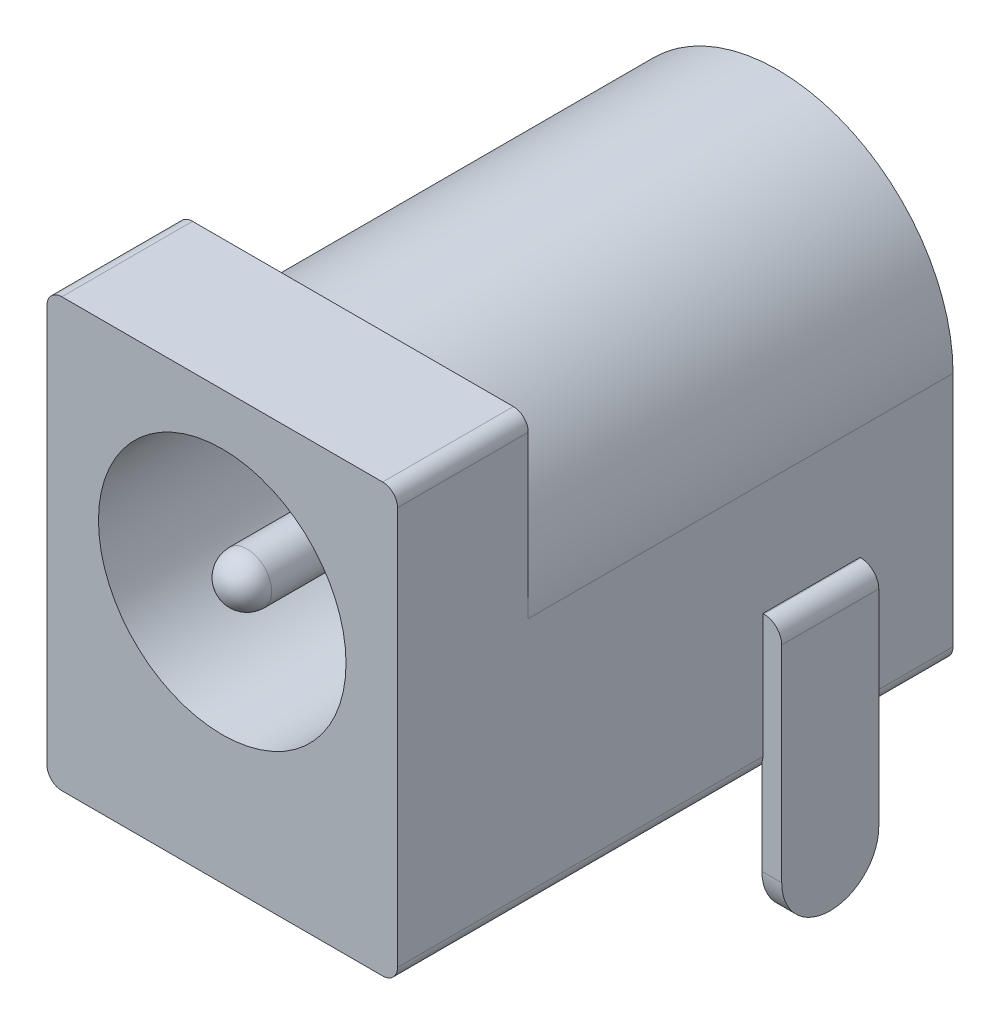
ISO-10303-21;
HEADER;
FILE_DESCRIPTION(('STEP AP214'),'2;1');
FILE_NAME('part.step','',(''),(''),'','','');
FILE_SCHEMA(('AUTOMOTIVE_DESIGN { 1 0 10303 214 1 1 1 1 }'));
ENDSEC;
DATA;
#1=APPLICATION_CONTEXT('core data for automotive mechanical design processes');
#2=APPLICATION_PROTOCOL_DEFINITION('international standard','automotive_design',2000,#1);
#3=PRODUCT_CONTEXT('',#1,'mechanical');
#4=PRODUCT('Part','Part','',(#3));
#5=PRODUCT_RELATED_PRODUCT_CATEGORY('part','',(#4));
#6=PRODUCT_DEFINITION_FORMATION('','',#4);
#7=PRODUCT_DEFINITION_CONTEXT('part definition',#1,'design');
#8=PRODUCT_DEFINITION('design','',#6,#7);
#9=PRODUCT_DEFINITION_SHAPE('','',#8);
#10=(LENGTH_UNIT() NAMED_UNIT(*) SI_UNIT(.MILLI.,.METRE.));
#11=(NAMED_UNIT(*) PLANE_ANGLE_UNIT() SI_UNIT($,.RADIAN.));
#12=(NAMED_UNIT(*) SI_UNIT($,.STERADIAN.) SOLID_ANGLE_UNIT());
#13=UNCERTAINTY_MEASURE_WITH_UNIT(LENGTH_MEASURE(1.E-05),#10,'distance_accuracy_value','');
#14=(GEOMETRIC_REPRESENTATION_CONTEXT(3) GLOBAL_UNCERTAINTY_ASSIGNED_CONTEXT((#13)) GLOBAL_UNIT_ASSIGNED_CONTEXT((#10,
#11,#12)) REPRESENTATION_CONTEXT('',''));
#15=CARTESIAN_POINT('',(0.,0.,0.));
#16=DIRECTION('',(0.,0.,1.));
#17=DIRECTION('',(1.,0.,0.));
#18=AXIS2_PLACEMENT_3D('',#15,#16,#17);
#19=CARTESIAN_POINT('',(8.9662,-3.683,2.3876));
#20=DIRECTION('',(-1.,0.,0.));
#21=DIRECTION('',(0.,0.,1.));
#22=AXIS2_PLACEMENT_3D('',#19,#20,#21);
#23=PLANE('',#22);
#24=DIRECTION('',(0.,1.,0.));
#25=VECTOR('',#24,1.);
#26=CARTESIAN_POINT('',(8.9662,-3.683,2.3876));
#27=LINE('',#26,#25);
#28=CARTESIAN_POINT('',(8.96619999999999,-2.1844,2.3876));
#29=VERTEX_POINT('',#28);
#30=CARTESIAN_POINT('',(8.9662,0.244216813898783,2.3876));
#31=VERTEX_POINT('',#30);
#32=EDGE_CURVE('E233',#29,#31,#27,.T.);
#33=ORIENTED_EDGE('',*,*,#32,.F.);
#34=CARTESIAN_POINT('',(8.96619999999999,-2.1844,3.6322));
#35=DIRECTION('',(1.,0.,0.));
#36=DIRECTION('',(0.,0.,-1.));
#37=AXIS2_PLACEMENT_3D('',#34,#35,#36);
#38=CIRCLE('',#37,1.2446);
#39=CARTESIAN_POINT('',(8.96619999999999,-2.1844,4.8768));
#40=VERTEX_POINT('',#39);
#41=EDGE_CURVE('E220',#40,#29,#38,.T.);
#42=ORIENTED_EDGE('',*,*,#41,.F.);
#43=DIRECTION('',(0.,1.,0.));
#44=VECTOR('',#43,1.);
#45=CARTESIAN_POINT('',(8.9662,-3.683,4.8768));
#46=LINE('',#45,#44);
#47=CARTESIAN_POINT('',(8.9662,0.244216813898783,4.8768));
#48=VERTEX_POINT('',#47);
#49=EDGE_CURVE('E253',#40,#48,#46,.T.);
#50=ORIENTED_EDGE('',*,*,#49,.T.);
#51=DIRECTION('',(0.,0.,-1.));
#52=VECTOR('',#51,1.);
#53=CARTESIAN_POINT('',(8.9662,0.244216813898783,14.2494));
#54=LINE('',#53,#52);
#55=EDGE_CURVE('E240',#31,#48,#54,.F.);
#56=ORIENTED_EDGE('',*,*,#55,.F.);
#57=EDGE_LOOP('',(#33,#42,#50,#56));
#58=FACE_BOUND('',#57,.T.);
#59=ADVANCED_FACE('F44',(#58),#23,.T.);
#60=CARTESIAN_POINT('',(8.9662,-3.683,2.3876));
#61=DIRECTION('',(0.,0.,1.));
#62=DIRECTION('',(1.,0.,0.));
#63=AXIS2_PLACEMENT_3D('',#60,#61,#62);
#64=PLANE('',#63);
#65=DIRECTION('',(1.,0.,0.));
#66=VECTOR('',#65,1.);
#67=CARTESIAN_POINT('',(8.96619999999999,-2.1844,2.3876));
#68=LINE('',#67,#66);
#69=CARTESIAN_POINT('',(9.47419999999999,-2.1844,2.3876));
#70=VERTEX_POINT('',#69);
#71=EDGE_CURVE('E59',#29,#70,#68,.T.);
#72=ORIENTED_EDGE('',*,*,#71,.F.);
#73=ORIENTED_EDGE('',*,*,#32,.T.);
#74=CARTESIAN_POINT('',(8.6106,0.380999999999999,2.3876));
#75=DIRECTION('',(0.,0.,1.));
#76=DIRECTION('',(1.,0.,0.));
#77=AXIS2_PLACEMENT_3D('',#74,#75,#76);
#78=CIRCLE('',#77,0.380999999999999);
#79=CARTESIAN_POINT('',(8.99159999999999,0.380999999999999,2.3876));
#80=VERTEX_POINT('',#79);
#81=EDGE_CURVE('E244',#31,#80,#78,.T.);
#82=ORIENTED_EDGE('',*,*,#81,.T.);
#83=DIRECTION('',(0.,-1.,0.));
#84=VECTOR('',#83,1.);
#85=CARTESIAN_POINT('',(8.9916,10.5918,2.3876));
#86=LINE('',#85,#84);
#87=CARTESIAN_POINT('',(8.9916,3.556,2.3876));
#88=VERTEX_POINT('',#87);
#89=EDGE_CURVE('E351',#88,#80,#86,.T.);
#90=ORIENTED_EDGE('',*,*,#89,.F.);
#91=DIRECTION('',(1.,0.,0.));
#92=VECTOR('',#91,1.);
#93=CARTESIAN_POINT('',(8.9662,3.556,2.3876));
#94=LINE('',#93,#92);
#95=CARTESIAN_POINT('',(9.017,3.556,2.3876));
#96=VERTEX_POINT('',#95);
#97=EDGE_CURVE('E249',#88,#96,#94,.T.);
#98=ORIENTED_EDGE('',*,*,#97,.T.);
#99=CARTESIAN_POINT('',(9.017,3.0988,2.3876));
#100=DIRECTION('',(0.,0.,1.));
#101=DIRECTION('',(1.,0.,0.));
#102=AXIS2_PLACEMENT_3D('',#99,#100,#101);
#103=CIRCLE('',#102,0.4572);
#104=CARTESIAN_POINT('',(9.47419999999999,3.0988,2.3876));
#105=VERTEX_POINT('',#104);
#106=EDGE_CURVE('E387',#96,#105,#103,.F.);
#107=ORIENTED_EDGE('',*,*,#106,.T.);
#108=DIRECTION('',(0.,1.,0.));
#109=VECTOR('',#108,1.);
#110=CARTESIAN_POINT('',(9.47419999999999,-3.683,2.3876));
#111=LINE('',#110,#109);
#112=EDGE_CURVE('E236',#70,#105,#111,.T.);
#113=ORIENTED_EDGE('',*,*,#112,.F.);
#114=EDGE_LOOP('',(#72,#73,#82,#90,#98,#107,#113));
#115=FACE_BOUND('',#114,.T.);
#116=ADVANCED_FACE('F231',(#115),#64,.F.);
#117=CARTESIAN_POINT('',(9.47419999999999,-3.683,4.8768));
#118=DIRECTION('',(1.,0.,0.));
#119=DIRECTION('',(0.,0.,-1.));
#120=AXIS2_PLACEMENT_3D('',#117,#118,#119);
#121=PLANE('',#120);
#122=DIRECTION('',(0.,1.,0.));
#123=VECTOR('',#122,1.);
#124=CARTESIAN_POINT('',(9.47419999999999,-3.683,4.8768));
#125=LINE('',#124,#123);
#126=CARTESIAN_POINT('',(9.47419999999999,-2.1844,4.8768));
#127=VERTEX_POINT('',#126);
#128=CARTESIAN_POINT('',(9.47419999999999,3.0988,4.8768));
#129=VERTEX_POINT('',#128);
#130=EDGE_CURVE('E246',#127,#129,#125,.T.);
#131=ORIENTED_EDGE('',*,*,#130,.F.);
#132=CARTESIAN_POINT('',(9.47419999999999,-2.1844,3.6322));
#133=DIRECTION('',(1.,0.,0.));
#134=DIRECTION('',(0.,0.,-1.));
#135=AXIS2_PLACEMENT_3D('',#132,#133,#134);
#136=CIRCLE('',#135,1.2446);
#137=EDGE_CURVE('E227',#127,#70,#136,.T.);
#138=ORIENTED_EDGE('',*,*,#137,.T.);
#139=ORIENTED_EDGE('',*,*,#112,.T.);
#140=DIRECTION('',(0.,0.,-1.));
#141=VECTOR('',#140,1.);
#142=CARTESIAN_POINT('',(9.47419999999999,3.0988,4.8768));
#143=LINE('',#142,#141);
#144=EDGE_CURVE('E389',#105,#129,#143,.F.);
#145=ORIENTED_EDGE('',*,*,#144,.T.);
#146=EDGE_LOOP('',(#131,#138,#139,#145));
#147=FACE_BOUND('',#146,.T.);
#148=ADVANCED_FACE('F448',(#147),#121,.T.);
#149=CARTESIAN_POINT('',(5.7404,-3.683,7.0104));
#150=DIRECTION('',(1.,0.,0.));
#151=DIRECTION('',(0.,0.,-1.));
#152=AXIS2_PLACEMENT_3D('',#149,#150,#151);
#153=PLANE('',#152);
#154=DIRECTION('',(0.,1.,0.));
#155=VECTOR('',#154,1.);
#156=CARTESIAN_POINT('',(5.7404,-3.683,7.0104));
#157=LINE('',#156,#155);
#158=CARTESIAN_POINT('',(5.7404,-2.1844,7.0104));
#159=VERTEX_POINT('',#158);
#160=CARTESIAN_POINT('',(5.7404,0.,7.0104));
#161=VERTEX_POINT('',#160);
#162=EDGE_CURVE('E478',#159,#161,#157,.T.);
#163=ORIENTED_EDGE('',*,*,#162,.F.);
#164=DIRECTION('',(0.,0.,-1.));
#165=VECTOR('',#164,1.);
#166=CARTESIAN_POINT('',(5.7404,-2.1844,7.26440000002886));
#167=LINE('',#166,#165);
#168=CARTESIAN_POINT('',(5.7404,-2.1844,6.75640000002886));
#169=VERTEX_POINT('',#168);
#170=EDGE_CURVE('E66',#159,#169,#167,.T.);
#171=ORIENTED_EDGE('',*,*,#170,.T.);
#172=DIRECTION('',(0.,1.,0.));
#173=VECTOR('',#172,1.);
#174=CARTESIAN_POINT('',(5.7404,-3.683,6.7564));
#175=LINE('',#174,#173);
#176=CARTESIAN_POINT('',(5.7404,0.,6.7564));
#177=VERTEX_POINT('',#176);
#178=EDGE_CURVE('E476',#169,#177,#175,.T.);
#179=ORIENTED_EDGE('',*,*,#178,.T.);
#180=DIRECTION('',(0.,0.,-1.));
#181=VECTOR('',#180,1.);
#182=CARTESIAN_POINT('',(5.74040000000005,0.,14.2494));
#183=LINE('',#182,#181);
#184=EDGE_CURVE('E378',#161,#177,#183,.T.);
#185=ORIENTED_EDGE('',*,*,#184,.F.);
#186=EDGE_LOOP('',(#163,#171,#179,#185));
#187=FACE_BOUND('',#186,.T.);
#188=ADVANCED_FACE('F612',(#187),#153,.T.);
#189=CARTESIAN_POINT('',(3.2512,-3.683,6.7564));
#190=DIRECTION('',(0.,0.,1.));
#191=DIRECTION('',(1.,0.,0.));
#192=AXIS2_PLACEMENT_3D('',#189,#190,#191);
#193=PLANE('',#192);
#194=CARTESIAN_POINT('',(4.4958,-2.1844,6.75640000002886));
#195=DIRECTION('',(0.,0.,-1.));
#196=DIRECTION('',(-1.,0.,0.));
#197=AXIS2_PLACEMENT_3D('',#194,#195,#196);
#198=CIRCLE('',#197,1.2446);
#199=CARTESIAN_POINT('',(3.2512,-2.1844,6.75640000002886));
#200=VERTEX_POINT('',#199);
#201=EDGE_CURVE('E445',#169,#200,#198,.T.);
#202=ORIENTED_EDGE('',*,*,#201,.T.);
#203=DIRECTION('',(0.,1.,0.));
#204=VECTOR('',#203,1.);
#205=CARTESIAN_POINT('',(3.2512,-3.683,6.7564));
#206=LINE('',#205,#204);
#207=CARTESIAN_POINT('',(3.2512,0.,6.7564));
#208=VERTEX_POINT('',#207);
#209=EDGE_CURVE('E473',#200,#208,#206,.T.);
#210=ORIENTED_EDGE('',*,*,#209,.T.);
#211=DIRECTION('',(1.,0.,0.));
#212=VECTOR('',#211,1.);
#213=CARTESIAN_POINT('',(0.381,0.,6.7564));
#214=LINE('',#213,#212);
#215=EDGE_CURVE('E483',#208,#177,#214,.T.);
#216=ORIENTED_EDGE('',*,*,#215,.T.);
#217=ORIENTED_EDGE('',*,*,#178,.F.);
#218=EDGE_LOOP('',(#202,#210,#216,#217));
#219=FACE_BOUND('',#218,.T.);
#220=ADVANCED_FACE('F601',(#219),#193,.F.);
#221=CARTESIAN_POINT('',(5.7404,-3.683,7.0104));
#222=DIRECTION('',(0.,0.,-1.));
#223=DIRECTION('',(-1.,0.,0.));
#224=AXIS2_PLACEMENT_3D('',#221,#222,#223);
#225=PLANE('',#224);
#226=CARTESIAN_POINT('',(4.4958,-2.1844,7.0104));
#227=DIRECTION('',(0.,0.,-1.));
#228=DIRECTION('',(-1.,0.,0.));
#229=AXIS2_PLACEMENT_3D('',#226,#227,#228);
#230=CIRCLE('',#229,1.2446);
#231=CARTESIAN_POINT('',(3.2512,-2.1844,7.0104));
#232=VERTEX_POINT('',#231);
#233=EDGE_CURVE('E12',#159,#232,#230,.T.);
#234=ORIENTED_EDGE('',*,*,#233,.F.);
#235=ORIENTED_EDGE('',*,*,#162,.T.);
#236=DIRECTION('',(-1.,0.,0.));
#237=VECTOR('',#236,1.);
#238=CARTESIAN_POINT('',(0.381,0.,7.0104));
#239=LINE('',#238,#237);
#240=CARTESIAN_POINT('',(3.2512,0.,7.0104));
#241=VERTEX_POINT('',#240);
#242=EDGE_CURVE('E475',#161,#241,#239,.T.);
#243=ORIENTED_EDGE('',*,*,#242,.T.);
#244=DIRECTION('',(0.,1.,0.));
#245=VECTOR('',#244,1.);
#246=CARTESIAN_POINT('',(3.2512,-3.683,7.0104));
#247=LINE('',#246,#245);
#248=EDGE_CURVE('E472',#232,#241,#247,.T.);
#249=ORIENTED_EDGE('',*,*,#248,.F.);
#250=EDGE_LOOP('',(#234,#235,#243,#249));
#251=FACE_BOUND('',#250,.T.);
#252=ADVANCED_FACE('F609',(#251),#225,.F.);
#253=CARTESIAN_POINT('',(2.9972,-3.683,0.381000000000002));
#254=DIRECTION('',(0.,0.,1.));
#255=DIRECTION('',(1.,0.,0.));
#256=AXIS2_PLACEMENT_3D('',#253,#254,#255);
#257=PLANE('',#256);
#258=CARTESIAN_POINT('',(4.4958,-1.9304,0.381000000000002));
#259=DIRECTION('',(0.,0.,-1.));
#260=DIRECTION('',(-1.,0.,0.));
#261=AXIS2_PLACEMENT_3D('',#258,#259,#260);
#262=CIRCLE('',#261,1.4986);
#263=CARTESIAN_POINT('',(5.9944,-1.9304,0.381000000000002));
#264=VERTEX_POINT('',#263);
#265=CARTESIAN_POINT('',(2.9972,-1.9304,0.381000000000002));
#266=VERTEX_POINT('',#265);
#267=EDGE_CURVE('E456',#264,#266,#262,.T.);
#268=ORIENTED_EDGE('',*,*,#267,.T.);
#269=DIRECTION('',(0.,1.,0.));
#270=VECTOR('',#269,1.);
#271=CARTESIAN_POINT('',(2.9972,-3.683,0.381000000000002));
#272=LINE('',#271,#270);
#273=CARTESIAN_POINT('',(2.9972,0.,0.381000000000002));
#274=VERTEX_POINT('',#273);
#275=EDGE_CURVE('E405',#266,#274,#272,.T.);
#276=ORIENTED_EDGE('',*,*,#275,.T.);
#277=DIRECTION('',(1.,0.,0.));
#278=VECTOR('',#277,1.);
#279=CARTESIAN_POINT('',(0.381,0.,0.381000000000002));
#280=LINE('',#279,#278);
#281=CARTESIAN_POINT('',(5.9944,0.,0.381000000000002));
#282=VERTEX_POINT('',#281);
#283=EDGE_CURVE('E360',#274,#282,#280,.T.);
#284=ORIENTED_EDGE('',*,*,#283,.T.);
#285=DIRECTION('',(0.,1.,0.));
#286=VECTOR('',#285,1.);
#287=CARTESIAN_POINT('',(5.9944,-3.683,0.381000000000002));
#288=LINE('',#287,#286);
#289=EDGE_CURVE('E488',#264,#282,#288,.T.);
#290=ORIENTED_EDGE('',*,*,#289,.F.);
#291=EDGE_LOOP('',(#268,#276,#284,#290));
#292=FACE_BOUND('',#291,.T.);
#293=ADVANCED_FACE('F512',(#292),#257,.F.);
#294=CARTESIAN_POINT('',(5.9944,-3.683,0.889000000000002));
#295=DIRECTION('',(1.,0.,0.));
#296=DIRECTION('',(0.,0.,-1.));
#297=AXIS2_PLACEMENT_3D('',#294,#295,#296);
#298=PLANE('',#297);
#299=DIRECTION('',(0.,1.,0.));
#300=VECTOR('',#299,1.);
#301=CARTESIAN_POINT('',(5.9944,-3.683,0.889000000000002));
#302=LINE('',#301,#300);
#303=CARTESIAN_POINT('',(5.9944,-1.9304,0.889000000000002));
#304=VERTEX_POINT('',#303);
#305=CARTESIAN_POINT('',(5.9944,0.,0.889000000000002));
#306=VERTEX_POINT('',#305);
#307=EDGE_CURVE('E490',#304,#306,#302,.T.);
#308=ORIENTED_EDGE('',*,*,#307,.F.);
#309=DIRECTION('',(0.,0.,-1.));
#310=VECTOR('',#309,1.);
#311=CARTESIAN_POINT('',(5.9944,-1.9304,0.889000000000003));
#312=LINE('',#311,#310);
#313=EDGE_CURVE('E459',#304,#264,#312,.T.);
#314=ORIENTED_EDGE('',*,*,#313,.T.);
#315=ORIENTED_EDGE('',*,*,#289,.T.);
#316=DIRECTION('',(0.,0.,-1.));
#317=VECTOR('',#316,1.);
#318=CARTESIAN_POINT('',(5.9944,0.,14.2494));
#319=LINE('',#318,#317);
#320=EDGE_CURVE('E357',#306,#282,#319,.T.);
#321=ORIENTED_EDGE('',*,*,#320,.F.);
#322=EDGE_LOOP('',(#308,#314,#315,#321));
#323=FACE_BOUND('',#322,.T.);
#324=ADVANCED_FACE('F509',(#323),#298,.T.);
#325=CARTESIAN_POINT('',(5.9944,-3.683,0.889000000000002));
#326=DIRECTION('',(0.,0.,-1.));
#327=DIRECTION('',(-1.,0.,0.));
#328=AXIS2_PLACEMENT_3D('',#325,#326,#327);
#329=PLANE('',#328);
#330=CARTESIAN_POINT('',(4.4958,-1.9304,0.889000000000003));
#331=DIRECTION('',(0.,0.,-1.));
#332=DIRECTION('',(-1.,0.,0.));
#333=AXIS2_PLACEMENT_3D('',#330,#331,#332);
#334=CIRCLE('',#333,1.4986);
#335=CARTESIAN_POINT('',(2.9972,-1.9304,0.889000000000003));
#336=VERTEX_POINT('',#335);
#337=EDGE_CURVE('E457',#304,#336,#334,.T.);
#338=ORIENTED_EDGE('',*,*,#337,.F.);
#339=ORIENTED_EDGE('',*,*,#307,.T.);
#340=DIRECTION('',(-1.,0.,0.));
#341=VECTOR('',#340,1.);
#342=CARTESIAN_POINT('',(0.380999999999999,0.,0.889000000000003));
#343=LINE('',#342,#341);
#344=CARTESIAN_POINT('',(2.9972,0.,0.889000000000003));
#345=VERTEX_POINT('',#344);
#346=EDGE_CURVE('E354',#306,#345,#343,.T.);
#347=ORIENTED_EDGE('',*,*,#346,.T.);
#348=DIRECTION('',(0.,1.,0.));
#349=VECTOR('',#348,1.);
#350=CARTESIAN_POINT('',(2.9972,-3.683,0.889000000000003));
#351=LINE('',#350,#349);
#352=EDGE_CURVE('E486',#336,#345,#351,.T.);
#353=ORIENTED_EDGE('',*,*,#352,.F.);
#354=EDGE_LOOP('',(#338,#339,#347,#353));
#355=FACE_BOUND('',#354,.T.);
#356=ADVANCED_FACE('F506',(#355),#329,.F.);
#357=CARTESIAN_POINT('',(4.4958,6.477,2.54));
#358=DIRECTION('',(0.,0.,1.));
#359=DIRECTION('',(1.,0.,0.));
#360=AXIS2_PLACEMENT_3D('',#357,#358,#359);
#361=CYLINDRICAL_SURFACE('',#360,3.175);
#362=CARTESIAN_POINT('',(4.4958,6.477,14.2494));
#363=DIRECTION('',(0.,0.,1.));
#364=DIRECTION('',(1.,0.,0.));
#365=AXIS2_PLACEMENT_3D('',#362,#363,#364);
#366=CIRCLE('',#365,3.175);
#367=CARTESIAN_POINT('',(7.6708,6.477,14.2494));
#368=VERTEX_POINT('',#367);
#369=EDGE_CURVE('E280',#368,#368,#366,.T.);
#370=ORIENTED_EDGE('',*,*,#369,.T.);
#371=EDGE_LOOP('',(#370));
#372=FACE_BOUND('',#371,.T.);
#373=CARTESIAN_POINT('',(4.4958,6.477,2.54));
#374=DIRECTION('',(0.,0.,1.));
#375=DIRECTION('',(1.,0.,0.));
#376=AXIS2_PLACEMENT_3D('',#373,#374,#375);
#377=CIRCLE('',#376,3.175);
#378=CARTESIAN_POINT('',(7.6708,6.477,2.54));
#379=VERTEX_POINT('',#378);
#380=EDGE_CURVE('E281',#379,#379,#377,.T.);
#381=ORIENTED_EDGE('',*,*,#380,.F.);
#382=EDGE_LOOP('',(#381));
#383=FACE_BOUND('',#382,.T.);
#384=DIRECTION('',(0.,0.,1.));
#385=VECTOR('',#384,1.);
#386=CARTESIAN_POINT('',(5.74014078933385,3.556,2.54));
#387=LINE('',#386,#385);
#388=CARTESIAN_POINT('',(5.74014078933385,3.556,7.0104));
#389=VERTEX_POINT('',#388);
#390=CARTESIAN_POINT('',(5.74014078933385,3.556,6.7564));
#391=VERTEX_POINT('',#390);
#392=EDGE_CURVE('E375',#389,#391,#387,.F.);
#393=ORIENTED_EDGE('',*,*,#392,.F.);
#394=CARTESIAN_POINT('',(4.4958,6.477,7.0104));
#395=DIRECTION('',(0.,0.,-1.));
#396=DIRECTION('',(-1.,0.,0.));
#397=AXIS2_PLACEMENT_3D('',#394,#395,#396);
#398=CIRCLE('',#397,3.175);
#399=CARTESIAN_POINT('',(3.25145921066615,3.556,7.0104));
#400=VERTEX_POINT('',#399);
#401=EDGE_CURVE('E369',#400,#389,#398,.F.);
#402=ORIENTED_EDGE('',*,*,#401,.F.);
#403=DIRECTION('',(0.,0.,1.));
#404=VECTOR('',#403,1.);
#405=CARTESIAN_POINT('',(3.25145921066615,3.556,2.54));
#406=LINE('',#405,#404);
#407=CARTESIAN_POINT('',(3.25145921066615,3.556,6.7564));
#408=VERTEX_POINT('',#407);
#409=EDGE_CURVE('E366',#408,#400,#406,.T.);
#410=ORIENTED_EDGE('',*,*,#409,.F.);
#411=CARTESIAN_POINT('',(4.4958,6.477,6.7564));
#412=DIRECTION('',(0.,0.,1.));
#413=DIRECTION('',(1.,0.,0.));
#414=AXIS2_PLACEMENT_3D('',#411,#412,#413);
#415=CIRCLE('',#414,3.175);
#416=EDGE_CURVE('E372',#391,#408,#415,.F.);
#417=ORIENTED_EDGE('',*,*,#416,.F.);
#418=EDGE_LOOP('',(#393,#402,#410,#417));
#419=FACE_BOUND('',#418,.T.);
#420=ADVANCED_FACE('F549',(#372,#383,#419),#361,.F.);
#421=CARTESIAN_POINT('',(8.6106,0.380999999999999,14.2494));
#422=DIRECTION('',(0.,0.,-1.));
#423=DIRECTION('',(-1.,0.,0.));
#424=AXIS2_PLACEMENT_3D('',#421,#422,#423);
#425=CYLINDRICAL_SURFACE('',#424,0.380999999999999);
#426=ORIENTED_EDGE('',*,*,#81,.F.);
#427=ORIENTED_EDGE('',*,*,#55,.T.);
#428=CARTESIAN_POINT('',(8.6106,0.380999999999999,4.8768));
#429=DIRECTION('',(0.,0.,-1.));
#430=DIRECTION('',(-1.,0.,0.));
#431=AXIS2_PLACEMENT_3D('',#428,#429,#430);
#432=CIRCLE('',#431,0.380999999999999);
#433=CARTESIAN_POINT('',(8.99159999999999,0.380999999999999,4.8768));
#434=VERTEX_POINT('',#433);
#435=EDGE_CURVE('E241',#434,#48,#432,.T.);
#436=ORIENTED_EDGE('',*,*,#435,.F.);
#437=DIRECTION('',(0.,0.,-1.));
#438=VECTOR('',#437,1.);
#439=CARTESIAN_POINT('',(8.99159999999999,0.380999999999999,14.2494));
#440=LINE('',#439,#438);
#441=CARTESIAN_POINT('',(8.99159999999999,0.380999999999999,14.2494));
#442=VERTEX_POINT('',#441);
#443=EDGE_CURVE('E329',#442,#434,#440,.T.);
#444=ORIENTED_EDGE('',*,*,#443,.F.);
#445=CARTESIAN_POINT('',(8.6106,0.380999999999999,14.2494));
#446=DIRECTION('',(0.,0.,1.));
#447=DIRECTION('',(1.,0.,0.));
#448=AXIS2_PLACEMENT_3D('',#445,#446,#447);
#449=CIRCLE('',#448,0.380999999999999);
#450=CARTESIAN_POINT('',(8.6106,0.,14.2494));
#451=VERTEX_POINT('',#450);
#452=EDGE_CURVE('E298',#451,#442,#449,.T.);
#453=ORIENTED_EDGE('',*,*,#452,.F.);
#454=DIRECTION('',(0.,0.,-1.));
#455=VECTOR('',#454,1.);
#456=CARTESIAN_POINT('',(8.6106,0.,14.2494));
#457=LINE('',#456,#455);
#458=CARTESIAN_POINT('',(8.6106,0.,0.));
#459=VERTEX_POINT('',#458);
#460=EDGE_CURVE('E332',#451,#459,#457,.T.);
#461=ORIENTED_EDGE('',*,*,#460,.T.);
#462=CARTESIAN_POINT('',(8.6106,0.380999999999999,0.));
#463=DIRECTION('',(0.,0.,1.));
#464=DIRECTION('',(1.,0.,0.));
#465=AXIS2_PLACEMENT_3D('',#462,#463,#464);
#466=CIRCLE('',#465,0.380999999999999);
#467=CARTESIAN_POINT('',(8.99159999999999,0.380999999999999,0.));
#468=VERTEX_POINT('',#467);
#469=EDGE_CURVE('E315',#459,#468,#466,.T.);
#470=ORIENTED_EDGE('',*,*,#469,.T.);
#471=EDGE_CURVE('E328',#80,#468,#440,.T.);
#472=ORIENTED_EDGE('',*,*,#471,.F.);
#473=EDGE_LOOP('',(#426,#427,#436,#444,#453,#461,#470,#472));
#474=FACE_BOUND('',#473,.T.);
#475=ADVANCED_FACE('F412',(#474),#425,.T.);
#476=CARTESIAN_POINT('',(8.9916,10.5918,14.2494));
#477=DIRECTION('',(1.,0.,0.));
#478=DIRECTION('',(0.,1.,0.));
#479=AXIS2_PLACEMENT_3D('',#476,#477,#478);
#480=PLANE('',#479);
#481=DIRECTION('',(0.,0.,1.));
#482=VECTOR('',#481,1.);
#483=CARTESIAN_POINT('',(8.9916,3.556,14.2494));
#484=LINE('',#483,#482);
#485=CARTESIAN_POINT('',(8.9916,3.556,4.8768));
#486=VERTEX_POINT('',#485);
#487=EDGE_CURVE('E345',#88,#486,#484,.T.);
#488=ORIENTED_EDGE('',*,*,#487,.F.);
#489=ORIENTED_EDGE('',*,*,#89,.T.);
#490=ORIENTED_EDGE('',*,*,#471,.T.);
#491=DIRECTION('',(0.,-1.,0.));
#492=VECTOR('',#491,1.);
#493=CARTESIAN_POINT('',(8.9916,10.5918,0.));
#494=LINE('',#493,#492);
#495=CARTESIAN_POINT('',(8.9916,6.4516,0.));
#496=VERTEX_POINT('',#495);
#497=EDGE_CURVE('E290',#496,#468,#494,.T.);
#498=ORIENTED_EDGE('',*,*,#497,.F.);
#499=DIRECTION('',(0.,0.,-1.));
#500=VECTOR('',#499,1.);
#501=CARTESIAN_POINT('',(8.9916,6.4516,24.3136992801287));
#502=LINE('',#501,#500);
#503=CARTESIAN_POINT('',(8.9916,6.4516,10.8966));
#504=VERTEX_POINT('',#503);
#505=EDGE_CURVE('E269',#504,#496,#502,.T.);
#506=ORIENTED_EDGE('',*,*,#505,.F.);
#507=DIRECTION('',(0.,-1.,0.));
#508=VECTOR('',#507,1.);
#509=CARTESIAN_POINT('',(8.9916,10.5918,10.8966));
#510=LINE('',#509,#508);
#511=CARTESIAN_POINT('',(8.9916,10.5918,10.8966));
#512=VERTEX_POINT('',#511);
#513=EDGE_CURVE('E266',#512,#504,#510,.T.);
#514=ORIENTED_EDGE('',*,*,#513,.F.);
#515=DIRECTION('',(0.,0.,-1.));
#516=VECTOR('',#515,1.);
#517=CARTESIAN_POINT('',(8.9916,10.5918,14.2494));
#518=LINE('',#517,#516);
#519=CARTESIAN_POINT('',(8.9916,10.5918,14.2494));
#520=VERTEX_POINT('',#519);
#521=EDGE_CURVE('E325',#520,#512,#518,.T.);
#522=ORIENTED_EDGE('',*,*,#521,.F.);
#523=DIRECTION('',(0.,-1.,0.));
#524=VECTOR('',#523,1.);
#525=CARTESIAN_POINT('',(8.9916,10.5918,14.2494));
#526=LINE('',#525,#524);
#527=EDGE_CURVE('E300',#520,#442,#526,.T.);
#528=ORIENTED_EDGE('',*,*,#527,.T.);
#529=ORIENTED_EDGE('',*,*,#443,.T.);
#530=DIRECTION('',(0.,1.,0.));
#531=VECTOR('',#530,1.);
#532=CARTESIAN_POINT('',(8.9916,10.5918,4.8768));
#533=LINE('',#532,#531);
#534=EDGE_CURVE('E348',#434,#486,#533,.T.);
#535=ORIENTED_EDGE('',*,*,#534,.T.);
#536=EDGE_LOOP('',(#488,#489,#490,#498,#506,#514,#522,#528,#529,#535));
#537=FACE_BOUND('',#536,.T.);
#538=ADVANCED_FACE('F409',(#537),#480,.T.);
#539=CARTESIAN_POINT('',(0.381,10.5918,0.));
#540=DIRECTION('',(0.,0.,1.));
#541=DIRECTION('',(1.,0.,0.));
#542=AXIS2_PLACEMENT_3D('',#539,#540,#541);
#543=PLANE('',#542);
#544=CARTESIAN_POINT('',(4.4958,6.4516,0.));
#545=DIRECTION('',(0.,0.,-1.));
#546=DIRECTION('',(-1.,0.,0.));
#547=AXIS2_PLACEMENT_3D('',#544,#545,#546);
#548=CIRCLE('',#547,4.4958);
#549=CARTESIAN_POINT('',(0.,6.4516,0.));
#550=VERTEX_POINT('',#549);
#551=EDGE_CURVE('E257',#550,#496,#548,.T.);
#552=ORIENTED_EDGE('',*,*,#551,.T.);
#553=ORIENTED_EDGE('',*,*,#497,.T.);
#554=ORIENTED_EDGE('',*,*,#469,.F.);
#555=DIRECTION('',(1.,0.,0.));
#556=VECTOR('',#555,1.);
#557=CARTESIAN_POINT('',(0.381,0.,0.));
#558=LINE('',#557,#556);
#559=CARTESIAN_POINT('',(0.381,0.,0.));
#560=VERTEX_POINT('',#559);
#561=EDGE_CURVE('E313',#560,#459,#558,.T.);
#562=ORIENTED_EDGE('',*,*,#561,.F.);
#563=CARTESIAN_POINT('',(0.381,0.381,0.));
#564=DIRECTION('',(0.,0.,-1.));
#565=DIRECTION('',(-1.,0.,0.));
#566=AXIS2_PLACEMENT_3D('',#563,#564,#565);
#567=CIRCLE('',#566,0.381);
#568=CARTESIAN_POINT('',(0.,0.381,0.));
#569=VERTEX_POINT('',#568);
#570=EDGE_CURVE('E310',#560,#569,#567,.T.);
#571=ORIENTED_EDGE('',*,*,#570,.T.);
#572=DIRECTION('',(0.,1.,0.));
#573=VECTOR('',#572,1.);
#574=CARTESIAN_POINT('',(0.,0.381,0.));
#575=LINE('',#574,#573);
#576=EDGE_CURVE('E284',#569,#550,#575,.T.);
#577=ORIENTED_EDGE('',*,*,#576,.T.);
#578=EDGE_LOOP('',(#552,#553,#554,#562,#571,#577));
#579=FACE_BOUND('',#578,.T.);
#580=ADVANCED_FACE('F418',(#579),#543,.F.);
#581=CARTESIAN_POINT('',(0.381,10.5918,14.2494));
#582=DIRECTION('',(0.,0.,-1.));
#583=DIRECTION('',(-1.,0.,0.));
#584=AXIS2_PLACEMENT_3D('',#581,#582,#583);
#585=CYLINDRICAL_SURFACE('',#584,0.381);
#586=DIRECTION('',(0.,0.,-1.));
#587=VECTOR('',#586,1.);
#588=CARTESIAN_POINT('',(0.381,10.9728,14.2494));
#589=LINE('',#588,#587);
#590=CARTESIAN_POINT('',(0.381,10.9728,14.2494));
#591=VERTEX_POINT('',#590);
#592=CARTESIAN_POINT('',(0.381,10.9728,10.8966));
#593=VERTEX_POINT('',#592);
#594=EDGE_CURVE('E307',#591,#593,#589,.T.);
#595=ORIENTED_EDGE('',*,*,#594,.T.);
#596=CARTESIAN_POINT('',(0.381,10.5918,10.8966));
#597=DIRECTION('',(0.,0.,1.));
#598=DIRECTION('',(1.,0.,0.));
#599=AXIS2_PLACEMENT_3D('',#596,#597,#598);
#600=CIRCLE('',#599,0.381);
#601=CARTESIAN_POINT('',(0.,10.5918,10.8966));
#602=VERTEX_POINT('',#601);
#603=EDGE_CURVE('E264',#602,#593,#600,.F.);
#604=ORIENTED_EDGE('',*,*,#603,.F.);
#605=DIRECTION('',(0.,0.,-1.));
#606=VECTOR('',#605,1.);
#607=CARTESIAN_POINT('',(0.,10.5918,14.2494));
#608=LINE('',#607,#606);
#609=CARTESIAN_POINT('',(0.,10.5918,14.2494));
#610=VERTEX_POINT('',#609);
#611=EDGE_CURVE('E339',#610,#602,#608,.T.);
#612=ORIENTED_EDGE('',*,*,#611,.F.);
#613=CARTESIAN_POINT('',(0.381,10.5918,14.2494));
#614=DIRECTION('',(0.,0.,1.));
#615=DIRECTION('',(1.,0.,0.));
#616=AXIS2_PLACEMENT_3D('',#613,#614,#615);
#617=CIRCLE('',#616,0.381);
#618=EDGE_CURVE('E287',#591,#610,#617,.T.);
#619=ORIENTED_EDGE('',*,*,#618,.F.);
#620=EDGE_LOOP('',(#595,#604,#612,#619));
#621=FACE_BOUND('',#620,.T.);
#622=ADVANCED_FACE('F558',(#621),#585,.T.);
#623=CARTESIAN_POINT('',(0.,0.381,14.2494));
#624=DIRECTION('',(-1.,0.,0.));
#625=DIRECTION('',(0.,-1.,0.));
#626=AXIS2_PLACEMENT_3D('',#623,#624,#625);
#627=PLANE('',#626);
#628=DIRECTION('',(0.,1.,0.));
#629=VECTOR('',#628,1.);
#630=CARTESIAN_POINT('',(0.,6.4516,10.8966));
#631=LINE('',#630,#629);
#632=CARTESIAN_POINT('',(0.,6.4516,10.8966));
#633=VERTEX_POINT('',#632);
#634=EDGE_CURVE('E262',#633,#602,#631,.T.);
#635=ORIENTED_EDGE('',*,*,#634,.F.);
#636=DIRECTION('',(0.,0.,-1.));
#637=VECTOR('',#636,1.);
#638=CARTESIAN_POINT('',(0.,6.4516,24.3136992801287));
#639=LINE('',#638,#637);
#640=EDGE_CURVE('E261',#633,#550,#639,.T.);
#641=ORIENTED_EDGE('',*,*,#640,.T.);
#642=ORIENTED_EDGE('',*,*,#576,.F.);
#643=DIRECTION('',(0.,0.,-1.));
#644=VECTOR('',#643,1.);
#645=CARTESIAN_POINT('',(0.,0.381,14.2494));
#646=LINE('',#645,#644);
#647=CARTESIAN_POINT('',(0.,0.381,14.2494));
#648=VERTEX_POINT('',#647);
#649=EDGE_CURVE('E337',#648,#569,#646,.T.);
#650=ORIENTED_EDGE('',*,*,#649,.F.);
#651=DIRECTION('',(0.,1.,0.));
#652=VECTOR('',#651,1.);
#653=CARTESIAN_POINT('',(0.,0.381,14.2494));
#654=LINE('',#653,#652);
#655=EDGE_CURVE('E289',#648,#610,#654,.T.);
#656=ORIENTED_EDGE('',*,*,#655,.T.);
#657=ORIENTED_EDGE('',*,*,#611,.T.);
#658=EDGE_LOOP('',(#635,#641,#642,#650,#656,#657));
#659=FACE_BOUND('',#658,.T.);
#660=ADVANCED_FACE('F573',(#659),#627,.T.);
#661=CARTESIAN_POINT('',(0.381,0.381,14.2494));
#662=DIRECTION('',(0.,0.,-1.));
#663=DIRECTION('',(-1.,0.,0.));
#664=AXIS2_PLACEMENT_3D('',#661,#662,#663);
#665=CYLINDRICAL_SURFACE('',#664,0.381);
#666=ORIENTED_EDGE('',*,*,#570,.F.);
#667=DIRECTION('',(0.,0.,-1.));
#668=VECTOR('',#667,1.);
#669=CARTESIAN_POINT('',(0.381,0.,14.2494));
#670=LINE('',#669,#668);
#671=CARTESIAN_POINT('',(0.381,0.,14.2494));
#672=VERTEX_POINT('',#671);
#673=EDGE_CURVE('E335',#672,#560,#670,.T.);
#674=ORIENTED_EDGE('',*,*,#673,.F.);
#675=CARTESIAN_POINT('',(0.381,0.381,14.2494));
#676=DIRECTION('',(0.,0.,-1.));
#677=DIRECTION('',(-1.,0.,0.));
#678=AXIS2_PLACEMENT_3D('',#675,#676,#677);
#679=CIRCLE('',#678,0.381);
#680=EDGE_CURVE('E293',#672,#648,#679,.T.);
#681=ORIENTED_EDGE('',*,*,#680,.T.);
#682=ORIENTED_EDGE('',*,*,#649,.T.);
#683=EDGE_LOOP('',(#666,#674,#681,#682));
#684=FACE_BOUND('',#683,.T.);
#685=ADVANCED_FACE('F569',(#684),#665,.T.);
#686=CARTESIAN_POINT('',(0.381,0.,14.2494));
#687=DIRECTION('',(0.,1.,0.));
#688=DIRECTION('',(0.,0.,1.));
#689=AXIS2_PLACEMENT_3D('',#686,#687,#688);
#690=PLANE('',#689);
#691=ORIENTED_EDGE('',*,*,#215,.F.);
#692=DIRECTION('',(0.,0.,1.));
#693=VECTOR('',#692,1.);
#694=CARTESIAN_POINT('',(3.25120000000001,0.,14.2494));
#695=LINE('',#694,#693);
#696=EDGE_CURVE('E381',#208,#241,#695,.T.);
#697=ORIENTED_EDGE('',*,*,#696,.T.);
#698=ORIENTED_EDGE('',*,*,#242,.F.);
#699=ORIENTED_EDGE('',*,*,#184,.T.);
#700=EDGE_LOOP('',(#691,#697,#698,#699));
#701=FACE_BOUND('',#700,.T.);
#702=ORIENTED_EDGE('',*,*,#283,.F.);
#703=DIRECTION('',(0.,0.,1.));
#704=VECTOR('',#703,1.);
#705=CARTESIAN_POINT('',(2.9972,0.,14.2494));
#706=LINE('',#705,#704);
#707=EDGE_CURVE('E363',#274,#345,#706,.T.);
#708=ORIENTED_EDGE('',*,*,#707,.T.);
#709=ORIENTED_EDGE('',*,*,#346,.F.);
#710=ORIENTED_EDGE('',*,*,#320,.T.);
#711=EDGE_LOOP('',(#702,#708,#709,#710));
#712=FACE_BOUND('',#711,.T.);
#713=ORIENTED_EDGE('',*,*,#561,.T.);
#714=ORIENTED_EDGE('',*,*,#460,.F.);
#715=DIRECTION('',(1.,0.,0.));
#716=VECTOR('',#715,1.);
#717=CARTESIAN_POINT('',(0.381,0.,14.2494));
#718=LINE('',#717,#716);
#719=EDGE_CURVE('E296',#672,#451,#718,.T.);
#720=ORIENTED_EDGE('',*,*,#719,.F.);
#721=ORIENTED_EDGE('',*,*,#673,.T.);
#722=EDGE_LOOP('',(#713,#714,#720,#721));
#723=FACE_BOUND('',#722,.T.);
#724=ADVANCED_FACE('F503',(#701,#712,#723),#690,.F.);
#725=CARTESIAN_POINT('',(8.6106,10.5918,14.2494));
#726=DIRECTION('',(0.,0.,-1.));
#727=DIRECTION('',(-1.,0.,0.));
#728=AXIS2_PLACEMENT_3D('',#725,#726,#727);
#729=CYLINDRICAL_SURFACE('',#728,0.380999999999999);
#730=ORIENTED_EDGE('',*,*,#521,.T.);
#731=CARTESIAN_POINT('',(8.6106,10.5918,10.8966));
#732=DIRECTION('',(0.,0.,1.));
#733=DIRECTION('',(1.,0.,0.));
#734=AXIS2_PLACEMENT_3D('',#731,#732,#733);
#735=CIRCLE('',#734,0.380999999999999);
#736=CARTESIAN_POINT('',(8.6106,10.9728,10.8966));
#737=VERTEX_POINT('',#736);
#738=EDGE_CURVE('E270',#737,#512,#735,.F.);
#739=ORIENTED_EDGE('',*,*,#738,.F.);
#740=DIRECTION('',(0.,0.,-1.));
#741=VECTOR('',#740,1.);
#742=CARTESIAN_POINT('',(8.6106,10.9728,14.2494));
#743=LINE('',#742,#741);
#744=CARTESIAN_POINT('',(8.6106,10.9728,14.2494));
#745=VERTEX_POINT('',#744);
#746=EDGE_CURVE('E322',#745,#737,#743,.T.);
#747=ORIENTED_EDGE('',*,*,#746,.F.);
#748=CARTESIAN_POINT('',(8.6106,10.5918,14.2494));
#749=DIRECTION('',(0.,0.,1.));
#750=DIRECTION('',(1.,0.,0.));
#751=AXIS2_PLACEMENT_3D('',#748,#749,#750);
#752=CIRCLE('',#751,0.380999999999999);
#753=EDGE_CURVE('E303',#520,#745,#752,.T.);
#754=ORIENTED_EDGE('',*,*,#753,.F.);
#755=EDGE_LOOP('',(#730,#739,#747,#754));
#756=FACE_BOUND('',#755,.T.);
#757=ADVANCED_FACE('F432',(#756),#729,.T.);
#758=CARTESIAN_POINT('',(8.6106,10.9728,14.2494));
#759=DIRECTION('',(0.,-1.,0.));
#760=DIRECTION('',(1.,0.,0.));
#761=AXIS2_PLACEMENT_3D('',#758,#759,#760);
#762=PLANE('',#761);
#763=ORIENTED_EDGE('',*,*,#746,.T.);
#764=DIRECTION('',(1.,0.,0.));
#765=VECTOR('',#764,1.);
#766=CARTESIAN_POINT('',(0.381,10.9728,10.8966));
#767=LINE('',#766,#765);
#768=EDGE_CURVE('E272',#593,#737,#767,.T.);
#769=ORIENTED_EDGE('',*,*,#768,.F.);
#770=ORIENTED_EDGE('',*,*,#594,.F.);
#771=DIRECTION('',(-1.,0.,0.));
#772=VECTOR('',#771,1.);
#773=CARTESIAN_POINT('',(8.6106,10.9728,14.2494));
#774=LINE('',#773,#772);
#775=EDGE_CURVE('E305',#745,#591,#774,.T.);
#776=ORIENTED_EDGE('',*,*,#775,.F.);
#777=EDGE_LOOP('',(#763,#769,#770,#776));
#778=FACE_BOUND('',#777,.T.);
#779=ADVANCED_FACE('F436',(#778),#762,.F.);
#780=CARTESIAN_POINT('',(0.381,10.5918,14.2494));
#781=DIRECTION('',(0.,0.,1.));
#782=DIRECTION('',(1.,0.,0.));
#783=AXIS2_PLACEMENT_3D('',#780,#781,#782);
#784=PLANE('',#783);
#785=ORIENTED_EDGE('',*,*,#369,.F.);
#786=EDGE_LOOP('',(#785));
#787=FACE_BOUND('',#786,.T.);
#788=ORIENTED_EDGE('',*,*,#618,.T.);
#789=ORIENTED_EDGE('',*,*,#655,.F.);
#790=ORIENTED_EDGE('',*,*,#680,.F.);
#791=ORIENTED_EDGE('',*,*,#719,.T.);
#792=ORIENTED_EDGE('',*,*,#452,.T.);
#793=ORIENTED_EDGE('',*,*,#527,.F.);
#794=ORIENTED_EDGE('',*,*,#753,.T.);
#795=ORIENTED_EDGE('',*,*,#775,.T.);
#796=EDGE_LOOP('',(#788,#789,#790,#791,#792,#793,#794,#795));
#797=FACE_BOUND('',#796,.T.);
#798=ADVANCED_FACE('F440',(#787,#797),#784,.T.);
#799=CARTESIAN_POINT('',(4.4958,6.477,2.54));
#800=DIRECTION('',(0.,0.,1.));
#801=DIRECTION('',(1.,0.,0.));
#802=AXIS2_PLACEMENT_3D('',#799,#800,#801);
#803=PLANE('',#802);
#804=CARTESIAN_POINT('',(4.4958,6.477,2.54));
#805=DIRECTION('',(0.,0.,1.));
#806=DIRECTION('',(1.,0.,0.));
#807=AXIS2_PLACEMENT_3D('',#804,#805,#806);
#808=CIRCLE('',#807,0.635000000000001);
#809=CARTESIAN_POINT('',(5.1308,6.477,2.54));
#810=VERTEX_POINT('',#809);
#811=EDGE_CURVE('E260',#810,#810,#808,.T.);
#812=ORIENTED_EDGE('',*,*,#811,.F.);
#813=EDGE_LOOP('',(#812));
#814=FACE_BOUND('',#813,.T.);
#815=ORIENTED_EDGE('',*,*,#380,.T.);
#816=EDGE_LOOP('',(#815));
#817=FACE_BOUND('',#816,.T.);
#818=ADVANCED_FACE('F544',(#814,#817),#803,.T.);
#819=CARTESIAN_POINT('',(4.4958,6.477,2.54));
#820=DIRECTION('',(0.,0.,1.));
#821=DIRECTION('',(1.,0.,0.));
#822=AXIS2_PLACEMENT_3D('',#819,#820,#821);
#823=CYLINDRICAL_SURFACE('',#822,0.635000000000001);
#824=CARTESIAN_POINT('',(4.4958,6.477,13.6144));
#825=DIRECTION('',(0.,0.,1.));
#826=DIRECTION('',(1.,0.,0.));
#827=AXIS2_PLACEMENT_3D('',#824,#825,#826);
#828=CIRCLE('',#827,0.635000000000001);
#829=CARTESIAN_POINT('',(5.1308,6.477,13.6144));
#830=VERTEX_POINT('',#829);
#831=EDGE_CURVE('E342',#830,#830,#828,.F.);
#832=ORIENTED_EDGE('',*,*,#831,.T.);
#833=EDGE_LOOP('',(#832));
#834=FACE_BOUND('',#833,.T.);
#835=ORIENTED_EDGE('',*,*,#811,.T.);
#836=EDGE_LOOP('',(#835));
#837=FACE_BOUND('',#836,.T.);
#838=ADVANCED_FACE('F541',(#834,#837),#823,.T.);
#839=CARTESIAN_POINT('',(4.4958,6.477,13.6144));
#840=DIRECTION('',(0.,0.,1.));
#841=DIRECTION('',(1.,0.,0.));
#842=AXIS2_PLACEMENT_3D('',#839,#840,#841);
#843=SPHERICAL_SURFACE('',#842,0.635);
#844=ORIENTED_EDGE('',*,*,#831,.F.);
#845=EDGE_LOOP('',(#844));
#846=FACE_BOUND('',#845,.T.);
#847=ADVANCED_FACE('F540',(#846),#843,.T.);
#848=CARTESIAN_POINT('',(0.381,10.5918,10.8966));
#849=DIRECTION('',(0.,0.,1.));
#850=DIRECTION('',(1.,0.,0.));
#851=AXIS2_PLACEMENT_3D('',#848,#849,#850);
#852=PLANE('',#851);
#853=ORIENTED_EDGE('',*,*,#634,.T.);
#854=ORIENTED_EDGE('',*,*,#603,.T.);
#855=ORIENTED_EDGE('',*,*,#768,.T.);
#856=ORIENTED_EDGE('',*,*,#738,.T.);
#857=ORIENTED_EDGE('',*,*,#513,.T.);
#858=CARTESIAN_POINT('',(4.4958,6.4516,10.8966));
#859=DIRECTION('',(0.,0.,1.));
#860=DIRECTION('',(1.,0.,0.));
#861=AXIS2_PLACEMENT_3D('',#858,#859,#860);
#862=CIRCLE('',#861,4.4958);
#863=EDGE_CURVE('E256',#633,#504,#862,.F.);
#864=ORIENTED_EDGE('',*,*,#863,.F.);
#865=EDGE_LOOP('',(#853,#854,#855,#856,#857,#864));
#866=FACE_BOUND('',#865,.T.);
#867=ADVANCED_FACE('F427',(#866),#852,.F.);
#868=CARTESIAN_POINT('',(4.4958,6.4516,24.3136992801287));
#869=DIRECTION('',(0.,0.,-1.));
#870=DIRECTION('',(-1.,0.,0.));
#871=AXIS2_PLACEMENT_3D('',#868,#869,#870);
#872=CYLINDRICAL_SURFACE('',#871,4.4958);
#873=ORIENTED_EDGE('',*,*,#863,.T.);
#874=ORIENTED_EDGE('',*,*,#505,.T.);
#875=ORIENTED_EDGE('',*,*,#551,.F.);
#876=ORIENTED_EDGE('',*,*,#640,.F.);
#877=EDGE_LOOP('',(#873,#874,#875,#876));
#878=FACE_BOUND('',#877,.T.);
#879=ADVANCED_FACE('F423',(#878),#872,.T.);
#880=CARTESIAN_POINT('',(9.47419999999999,-3.683,4.8768));
#881=DIRECTION('',(0.,0.,-1.));
#882=DIRECTION('',(-1.,0.,0.));
#883=AXIS2_PLACEMENT_3D('',#880,#881,#882);
#884=PLANE('',#883);
#885=ORIENTED_EDGE('',*,*,#49,.F.);
#886=DIRECTION('',(1.,0.,0.));
#887=VECTOR('',#886,1.);
#888=CARTESIAN_POINT('',(8.96619999999999,-2.1844,4.8768));
#889=LINE('',#888,#887);
#890=EDGE_CURVE('E223',#40,#127,#889,.T.);
#891=ORIENTED_EDGE('',*,*,#890,.T.);
#892=ORIENTED_EDGE('',*,*,#130,.T.);
#893=CARTESIAN_POINT('',(9.017,3.0988,4.8768));
#894=DIRECTION('',(0.,0.,-1.));
#895=DIRECTION('',(-1.,0.,0.));
#896=AXIS2_PLACEMENT_3D('',#893,#894,#895);
#897=CIRCLE('',#896,0.4572);
#898=CARTESIAN_POINT('',(9.017,3.556,4.8768));
#899=VERTEX_POINT('',#898);
#900=EDGE_CURVE('E52',#129,#899,#897,.F.);
#901=ORIENTED_EDGE('',*,*,#900,.T.);
#902=DIRECTION('',(-1.,0.,0.));
#903=VECTOR('',#902,1.);
#904=CARTESIAN_POINT('',(9.47419999999999,3.556,4.8768));
#905=LINE('',#904,#903);
#906=EDGE_CURVE('E396',#899,#486,#905,.T.);
#907=ORIENTED_EDGE('',*,*,#906,.T.);
#908=ORIENTED_EDGE('',*,*,#534,.F.);
#909=ORIENTED_EDGE('',*,*,#435,.T.);
#910=EDGE_LOOP('',(#885,#891,#892,#901,#907,#908,#909));
#911=FACE_BOUND('',#910,.T.);
#912=ADVANCED_FACE('F394',(#911),#884,.F.);
#913=CARTESIAN_POINT('',(8.9662,3.556,2.3876));
#914=DIRECTION('',(0.,1.,0.));
#915=DIRECTION('',(0.,0.,1.));
#916=AXIS2_PLACEMENT_3D('',#913,#914,#915);
#917=PLANE('',#916);
#918=ORIENTED_EDGE('',*,*,#906,.F.);
#919=DIRECTION('',(0.,0.,-1.));
#920=VECTOR('',#919,1.);
#921=CARTESIAN_POINT('',(9.017,3.556,2.3876));
#922=LINE('',#921,#920);
#923=EDGE_CURVE('E384',#899,#96,#922,.T.);
#924=ORIENTED_EDGE('',*,*,#923,.T.);
#925=ORIENTED_EDGE('',*,*,#97,.F.);
#926=ORIENTED_EDGE('',*,*,#487,.T.);
#927=EDGE_LOOP('',(#918,#924,#925,#926));
#928=FACE_BOUND('',#927,.T.);
#929=ADVANCED_FACE('F402',(#928),#917,.T.);
#930=CARTESIAN_POINT('',(2.9972,-3.683,0.381000000000002));
#931=DIRECTION('',(-1.,0.,0.));
#932=DIRECTION('',(0.,0.,1.));
#933=AXIS2_PLACEMENT_3D('',#930,#931,#932);
#934=PLANE('',#933);
#935=DIRECTION('',(0.,0.,-1.));
#936=VECTOR('',#935,1.);
#937=CARTESIAN_POINT('',(2.9972,-1.9304,0.889000000000003));
#938=LINE('',#937,#936);
#939=EDGE_CURVE('E464',#336,#266,#938,.T.);
#940=ORIENTED_EDGE('',*,*,#939,.F.);
#941=ORIENTED_EDGE('',*,*,#352,.T.);
#942=ORIENTED_EDGE('',*,*,#707,.F.);
#943=ORIENTED_EDGE('',*,*,#275,.F.);
#944=EDGE_LOOP('',(#940,#941,#942,#943));
#945=FACE_BOUND('',#944,.T.);
#946=ADVANCED_FACE('F496',(#945),#934,.T.);
#947=CARTESIAN_POINT('',(3.2512,3.556,7.0104));
#948=DIRECTION('',(0.,-1.,0.));
#949=DIRECTION('',(0.,0.,-1.));
#950=AXIS2_PLACEMENT_3D('',#947,#948,#949);
#951=PLANE('',#950);
#952=DIRECTION('',(-1.,0.,0.));
#953=VECTOR('',#952,1.);
#954=CARTESIAN_POINT('',(5.7404,3.556,7.0104));
#955=LINE('',#954,#953);
#956=EDGE_CURVE('E466',#389,#400,#955,.T.);
#957=ORIENTED_EDGE('',*,*,#956,.F.);
#958=ORIENTED_EDGE('',*,*,#392,.T.);
#959=DIRECTION('',(1.,0.,0.));
#960=VECTOR('',#959,1.);
#961=CARTESIAN_POINT('',(3.2512,3.556,6.7564));
#962=LINE('',#961,#960);
#963=EDGE_CURVE('E469',#408,#391,#962,.T.);
#964=ORIENTED_EDGE('',*,*,#963,.F.);
#965=ORIENTED_EDGE('',*,*,#409,.T.);
#966=EDGE_LOOP('',(#957,#958,#964,#965));
#967=FACE_BOUND('',#966,.T.);
#968=ADVANCED_FACE('F596',(#967),#951,.F.);
#969=ORIENTED_EDGE('',*,*,#956,.T.);
#970=ORIENTED_EDGE('',*,*,#401,.T.);
#971=EDGE_LOOP('',(#969,#970));
#972=FACE_BOUND('',#971,.T.);
#973=ADVANCED_FACE('F595',(#972),#225,.F.);
#974=ORIENTED_EDGE('',*,*,#963,.T.);
#975=ORIENTED_EDGE('',*,*,#416,.T.);
#976=EDGE_LOOP('',(#974,#975));
#977=FACE_BOUND('',#976,.T.);
#978=ADVANCED_FACE('F598',(#977),#193,.F.);
#979=CARTESIAN_POINT('',(3.2512,-3.683,6.7564));
#980=DIRECTION('',(-1.,0.,0.));
#981=DIRECTION('',(0.,0.,1.));
#982=AXIS2_PLACEMENT_3D('',#979,#980,#981);
#983=PLANE('',#982);
#984=DIRECTION('',(0.,0.,-1.));
#985=VECTOR('',#984,1.);
#986=CARTESIAN_POINT('',(3.2512,-2.1844,7.26440000002886));
#987=LINE('',#986,#985);
#988=EDGE_CURVE('E454',#232,#200,#987,.T.);
#989=ORIENTED_EDGE('',*,*,#988,.F.);
#990=ORIENTED_EDGE('',*,*,#248,.T.);
#991=ORIENTED_EDGE('',*,*,#696,.F.);
#992=ORIENTED_EDGE('',*,*,#209,.F.);
#993=EDGE_LOOP('',(#989,#990,#991,#992));
#994=FACE_BOUND('',#993,.T.);
#995=ADVANCED_FACE('F525',(#994),#983,.T.);
#996=CARTESIAN_POINT('',(9.017,3.0988,2.3876));
#997=DIRECTION('',(0.,0.,-1.));
#998=DIRECTION('',(-1.,0.,0.));
#999=AXIS2_PLACEMENT_3D('',#996,#997,#998);
#1000=CYLINDRICAL_SURFACE('',#999,0.4572);
#1001=ORIENTED_EDGE('',*,*,#900,.F.);
#1002=ORIENTED_EDGE('',*,*,#144,.F.);
#1003=ORIENTED_EDGE('',*,*,#106,.F.);
#1004=ORIENTED_EDGE('',*,*,#923,.F.);
#1005=EDGE_LOOP('',(#1001,#1002,#1003,#1004));
#1006=FACE_BOUND('',#1005,.T.);
#1007=ADVANCED_FACE('F46',(#1006),#1000,.T.);
#1008=CARTESIAN_POINT('',(4.4958,-1.9304,0.889000000000003));
#1009=DIRECTION('',(0.,0.,-1.));
#1010=DIRECTION('',(-1.,0.,0.));
#1011=AXIS2_PLACEMENT_3D('',#1008,#1009,#1010);
#1012=CYLINDRICAL_SURFACE('',#1011,1.4986);
#1013=ORIENTED_EDGE('',*,*,#267,.F.);
#1014=ORIENTED_EDGE('',*,*,#313,.F.);
#1015=ORIENTED_EDGE('',*,*,#337,.T.);
#1016=ORIENTED_EDGE('',*,*,#939,.T.);
#1017=EDGE_LOOP('',(#1013,#1014,#1015,#1016));
#1018=FACE_BOUND('',#1017,.T.);
#1019=ADVANCED_FACE('F514',(#1018),#1012,.T.);
#1020=CARTESIAN_POINT('',(4.4958,-2.1844,7.26440000002886));
#1021=DIRECTION('',(0.,0.,-1.));
#1022=DIRECTION('',(-1.,0.,0.));
#1023=AXIS2_PLACEMENT_3D('',#1020,#1021,#1022);
#1024=CYLINDRICAL_SURFACE('',#1023,1.2446);
#1025=ORIENTED_EDGE('',*,*,#233,.T.);
#1026=ORIENTED_EDGE('',*,*,#988,.T.);
#1027=ORIENTED_EDGE('',*,*,#201,.F.);
#1028=ORIENTED_EDGE('',*,*,#170,.F.);
#1029=EDGE_LOOP('',(#1025,#1026,#1027,#1028));
#1030=FACE_BOUND('',#1029,.T.);
#1031=ADVANCED_FACE('F516',(#1030),#1024,.T.);
#1032=CARTESIAN_POINT('',(8.96619999999999,-2.1844,3.6322));
#1033=DIRECTION('',(1.,0.,0.));
#1034=DIRECTION('',(0.,0.,-1.));
#1035=AXIS2_PLACEMENT_3D('',#1032,#1033,#1034);
#1036=CYLINDRICAL_SURFACE('',#1035,1.2446);
#1037=ORIENTED_EDGE('',*,*,#137,.F.);
#1038=ORIENTED_EDGE('',*,*,#890,.F.);
#1039=ORIENTED_EDGE('',*,*,#41,.T.);
#1040=ORIENTED_EDGE('',*,*,#71,.T.);
#1041=EDGE_LOOP('',(#1037,#1038,#1039,#1040));
#1042=FACE_BOUND('',#1041,.T.);
#1043=ADVANCED_FACE('F221',(#1042),#1036,.T.);
#1044=CLOSED_SHELL('',(#59,#116,#148,#188,#220,#252,#293,#324,#356,#420,#475,#538,#580,#622,
#660,#685,#724,#757,#779,#798,#818,#838,#847,#867,#879,#912,#929,#946,#968,#973,#978,#995,#1007,
#1019,#1031,#1043));
#1045=MANIFOLD_SOLID_BREP('B2',#1044);
#1046=ADVANCED_BREP_SHAPE_REPRESENTATION('',(#18,#1045),#14);
#1047=SHAPE_DEFINITION_REPRESENTATION(#9,#1046);
ENDSEC;
END-ISO-10303-21;
